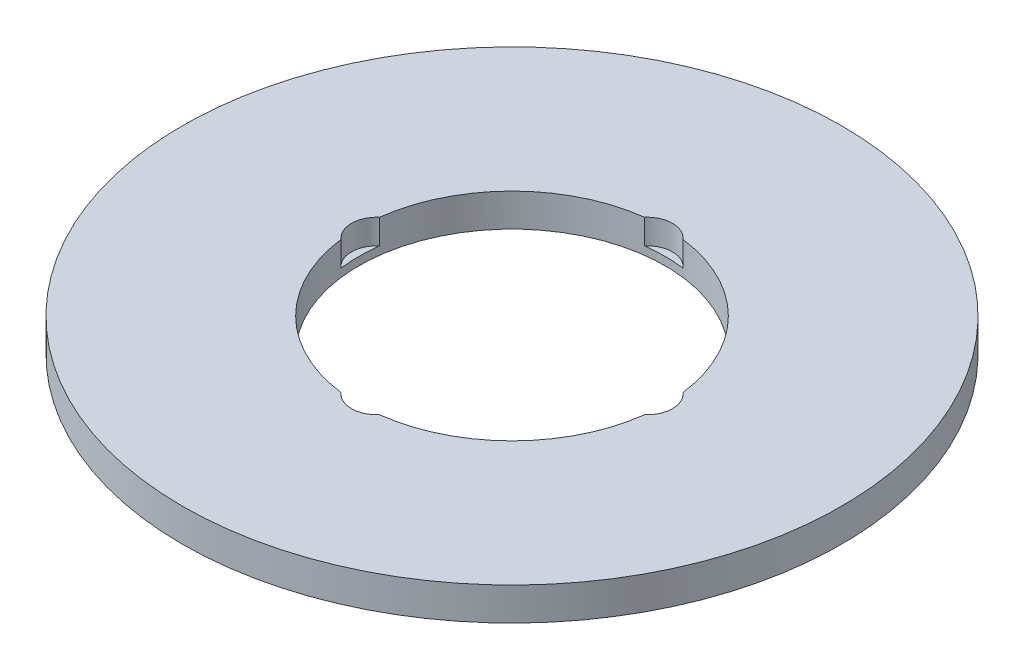
ISO-10303-21;
HEADER;
FILE_DESCRIPTION(('STEP AP214'),'2;1');
FILE_NAME('part.step','',(''),(''),'','','');
FILE_SCHEMA(('AUTOMOTIVE_DESIGN { 1 0 10303 214 1 1 1 1 }'));
ENDSEC;
DATA;
#1=APPLICATION_CONTEXT('core data for automotive mechanical design processes');
#2=APPLICATION_PROTOCOL_DEFINITION('international standard','automotive_design',2000,#1);
#3=PRODUCT_CONTEXT('',#1,'mechanical');
#4=PRODUCT('Part','Part','',(#3));
#5=PRODUCT_RELATED_PRODUCT_CATEGORY('part','',(#4));
#6=PRODUCT_DEFINITION_FORMATION('','',#4);
#7=PRODUCT_DEFINITION_CONTEXT('part definition',#1,'design');
#8=PRODUCT_DEFINITION('design','',#6,#7);
#9=PRODUCT_DEFINITION_SHAPE('','',#8);
#10=(LENGTH_UNIT() NAMED_UNIT(*) SI_UNIT(.MILLI.,.METRE.));
#11=(NAMED_UNIT(*) PLANE_ANGLE_UNIT() SI_UNIT($,.RADIAN.));
#12=(NAMED_UNIT(*) SI_UNIT($,.STERADIAN.) SOLID_ANGLE_UNIT());
#13=UNCERTAINTY_MEASURE_WITH_UNIT(LENGTH_MEASURE(1.E-05),#10,'distance_accuracy_value','');
#14=(GEOMETRIC_REPRESENTATION_CONTEXT(3) GLOBAL_UNCERTAINTY_ASSIGNED_CONTEXT((#13)) GLOBAL_UNIT_ASSIGNED_CONTEXT((#10,
#11,#12)) REPRESENTATION_CONTEXT('',''));
#15=CARTESIAN_POINT('',(0.,0.,0.));
#16=DIRECTION('',(0.,0.,1.));
#17=DIRECTION('',(1.,0.,0.));
#18=AXIS2_PLACEMENT_3D('',#15,#16,#17);
#19=CARTESIAN_POINT('',(0.,7.,0.));
#20=DIRECTION('',(0.,-1.,0.));
#21=DIRECTION('',(0.,0.,-1.));
#22=AXIS2_PLACEMENT_3D('',#19,#20,#21);
#23=CYLINDRICAL_SURFACE('',#22,70.);
#24=CARTESIAN_POINT('',(0.,7.,0.));
#25=DIRECTION('',(0.,1.,0.));
#26=DIRECTION('',(0.,0.,1.));
#27=AXIS2_PLACEMENT_3D('',#24,#25,#26);
#28=CIRCLE('',#27,70.);
#29=CARTESIAN_POINT('',(0.,7.,70.));
#30=VERTEX_POINT('',#29);
#31=EDGE_CURVE('E148',#30,#30,#28,.T.);
#32=ORIENTED_EDGE('',*,*,#31,.F.);
#33=EDGE_LOOP('',(#32));
#34=FACE_BOUND('',#33,.T.);
#35=CARTESIAN_POINT('',(0.,0.,0.));
#36=DIRECTION('',(0.,1.,0.));
#37=DIRECTION('',(0.,0.,1.));
#38=AXIS2_PLACEMENT_3D('',#35,#36,#37);
#39=CIRCLE('',#38,70.);
#40=CARTESIAN_POINT('',(0.,0.,70.));
#41=VERTEX_POINT('',#40);
#42=EDGE_CURVE('E139',#41,#41,#39,.T.);
#43=ORIENTED_EDGE('',*,*,#42,.T.);
#44=EDGE_LOOP('',(#43));
#45=FACE_BOUND('',#44,.T.);
#46=ADVANCED_FACE('F39',(#34,#45),#23,.T.);
#47=CARTESIAN_POINT('',(0.,7.,0.));
#48=DIRECTION('',(0.,1.,0.));
#49=DIRECTION('',(0.,0.,1.));
#50=AXIS2_PLACEMENT_3D('',#47,#48,#49);
#51=PLANE('',#50);
#52=CARTESIAN_POINT('',(1.00227771130218E-13,7.,28.7063745737868));
#53=DIRECTION('',(0.,1.,0.));
#54=DIRECTION('',(1.,0.,0.));
#55=AXIS2_PLACEMENT_3D('',#52,#53,#54);
#56=CIRCLE('',#55,5.39647242135596);
#57=CARTESIAN_POINT('',(-4.07567725503666,7.,32.243431190132));
#58=VERTEX_POINT('',#57);
#59=CARTESIAN_POINT('',(4.07567725503688,7.,32.243431190132));
#60=VERTEX_POINT('',#59);
#61=EDGE_CURVE('E175',#58,#60,#56,.T.);
#62=ORIENTED_EDGE('',*,*,#61,.F.);
#63=CARTESIAN_POINT('',(0.,7.,0.));
#64=DIRECTION('',(0.,1.,0.));
#65=DIRECTION('',(0.,0.,1.));
#66=AXIS2_PLACEMENT_3D('',#63,#64,#65);
#67=CIRCLE('',#66,32.5);
#68=CARTESIAN_POINT('',(-32.243431190132,7.,4.07567725503677));
#69=VERTEX_POINT('',#68);
#70=EDGE_CURVE('E134',#69,#58,#67,.T.);
#71=ORIENTED_EDGE('',*,*,#70,.F.);
#72=CARTESIAN_POINT('',(-28.7063745737868,7.,0.));
#73=DIRECTION('',(0.,1.,0.));
#74=DIRECTION('',(0.,0.,1.));
#75=AXIS2_PLACEMENT_3D('',#72,#73,#74);
#76=CIRCLE('',#75,5.39647242135596);
#77=CARTESIAN_POINT('',(-32.243431190132,7.,-4.07567725503677));
#78=VERTEX_POINT('',#77);
#79=EDGE_CURVE('E143',#78,#69,#76,.T.);
#80=ORIENTED_EDGE('',*,*,#79,.F.);
#81=CARTESIAN_POINT('',(-4.07567725503711,7.,-32.2434311901319));
#82=VERTEX_POINT('',#81);
#83=EDGE_CURVE('E123',#82,#78,#67,.T.);
#84=ORIENTED_EDGE('',*,*,#83,.F.);
#85=CARTESIAN_POINT('',(-3.00683313390653E-13,7.,-28.7063745737868));
#86=DIRECTION('',(0.,1.,0.));
#87=DIRECTION('',(-1.,0.,0.));
#88=AXIS2_PLACEMENT_3D('',#85,#86,#87);
#89=CIRCLE('',#88,5.39647242135596);
#90=CARTESIAN_POINT('',(4.07567725503643,7.,-32.243431190132));
#91=VERTEX_POINT('',#90);
#92=EDGE_CURVE('E106',#91,#82,#89,.T.);
#93=ORIENTED_EDGE('',*,*,#92,.F.);
#94=CARTESIAN_POINT('',(32.243431190132,7.,-4.07567725503677));
#95=VERTEX_POINT('',#94);
#96=EDGE_CURVE('E125',#95,#91,#67,.T.);
#97=ORIENTED_EDGE('',*,*,#96,.F.);
#98=CARTESIAN_POINT('',(28.7063745737868,7.,0.));
#99=DIRECTION('',(0.,1.,0.));
#100=DIRECTION('',(0.,0.,-1.));
#101=AXIS2_PLACEMENT_3D('',#98,#99,#100);
#102=CIRCLE('',#101,5.39647242135596);
#103=CARTESIAN_POINT('',(32.243431190132,7.,4.07567725503677));
#104=VERTEX_POINT('',#103);
#105=EDGE_CURVE('E286',#104,#95,#102,.T.);
#106=ORIENTED_EDGE('',*,*,#105,.F.);
#107=EDGE_CURVE('E135',#60,#104,#67,.T.);
#108=ORIENTED_EDGE('',*,*,#107,.F.);
#109=EDGE_LOOP('',(#62,#71,#80,#84,#93,#97,#106,#108));
#110=FACE_BOUND('',#109,.T.);
#111=ORIENTED_EDGE('',*,*,#31,.T.);
#112=EDGE_LOOP('',(#111));
#113=FACE_BOUND('',#112,.T.);
#114=ADVANCED_FACE('F118',(#110,#113),#51,.T.);
#115=CARTESIAN_POINT('',(0.,0.,0.));
#116=DIRECTION('',(0.,1.,0.));
#117=DIRECTION('',(0.,0.,1.));
#118=AXIS2_PLACEMENT_3D('',#115,#116,#117);
#119=PLANE('',#118);
#120=CARTESIAN_POINT('',(0.,0.,0.));
#121=DIRECTION('',(0.,1.,0.));
#122=DIRECTION('',(0.,0.,1.));
#123=AXIS2_PLACEMENT_3D('',#120,#121,#122);
#124=CIRCLE('',#123,32.5);
#125=CARTESIAN_POINT('',(0.,0.,32.5));
#126=VERTEX_POINT('',#125);
#127=EDGE_CURVE('E136',#126,#126,#124,.T.);
#128=ORIENTED_EDGE('',*,*,#127,.T.);
#129=EDGE_LOOP('',(#128));
#130=FACE_BOUND('',#129,.T.);
#131=ORIENTED_EDGE('',*,*,#42,.F.);
#132=EDGE_LOOP('',(#131));
#133=FACE_BOUND('',#132,.T.);
#134=ADVANCED_FACE('F187',(#130,#133),#119,.F.);
#135=CARTESIAN_POINT('',(0.,7.,0.));
#136=DIRECTION('',(0.,-1.,0.));
#137=DIRECTION('',(0.,0.,-1.));
#138=AXIS2_PLACEMENT_3D('',#135,#136,#137);
#139=CYLINDRICAL_SURFACE('',#138,32.5);
#140=DIRECTION('',(0.,1.,0.));
#141=VECTOR('',#140,1.);
#142=CARTESIAN_POINT('',(-4.07567725503666,4.36564411451568,32.243431190132));
#143=LINE('',#142,#141);
#144=CARTESIAN_POINT('',(-4.07567725503666,1.73128822903137,32.243431190132));
#145=VERTEX_POINT('',#144);
#146=EDGE_CURVE('E11',#145,#58,#143,.T.);
#147=ORIENTED_EDGE('',*,*,#146,.F.);
#148=CARTESIAN_POINT('',(0.,1.73128822903137,0.));
#149=DIRECTION('',(0.,1.,0.));
#150=DIRECTION('',(0.,0.,1.));
#151=AXIS2_PLACEMENT_3D('',#148,#149,#150);
#152=CIRCLE('',#151,32.5);
#153=CARTESIAN_POINT('',(4.07567725503688,1.73128822903137,32.243431190132));
#154=VERTEX_POINT('',#153);
#155=EDGE_CURVE('E170',#145,#154,#152,.T.);
#156=ORIENTED_EDGE('',*,*,#155,.T.);
#157=DIRECTION('',(0.,1.,0.));
#158=VECTOR('',#157,1.);
#159=CARTESIAN_POINT('',(4.07567725503688,4.36564411451568,32.243431190132));
#160=LINE('',#159,#158);
#161=EDGE_CURVE('E46',#60,#154,#160,.F.);
#162=ORIENTED_EDGE('',*,*,#161,.F.);
#163=ORIENTED_EDGE('',*,*,#107,.T.);
#164=DIRECTION('',(0.,1.,0.));
#165=VECTOR('',#164,1.);
#166=CARTESIAN_POINT('',(32.243431190132,4.36564411451568,4.07567725503677));
#167=LINE('',#166,#165);
#168=CARTESIAN_POINT('',(32.243431190132,1.73128822903137,4.07567725503677));
#169=VERTEX_POINT('',#168);
#170=EDGE_CURVE('E164',#169,#104,#167,.T.);
#171=ORIENTED_EDGE('',*,*,#170,.F.);
#172=CARTESIAN_POINT('',(0.,1.73128822903137,0.));
#173=DIRECTION('',(0.,1.,0.));
#174=DIRECTION('',(0.,0.,1.));
#175=AXIS2_PLACEMENT_3D('',#172,#173,#174);
#176=CIRCLE('',#175,32.5);
#177=CARTESIAN_POINT('',(32.243431190132,1.73128822903137,-4.07567725503677));
#178=VERTEX_POINT('',#177);
#179=EDGE_CURVE('E115',#169,#178,#176,.T.);
#180=ORIENTED_EDGE('',*,*,#179,.T.);
#181=DIRECTION('',(0.,1.,0.));
#182=VECTOR('',#181,1.);
#183=CARTESIAN_POINT('',(32.243431190132,4.36564411451568,-4.07567725503677));
#184=LINE('',#183,#182);
#185=EDGE_CURVE('E131',#95,#178,#184,.F.);
#186=ORIENTED_EDGE('',*,*,#185,.F.);
#187=ORIENTED_EDGE('',*,*,#96,.T.);
#188=DIRECTION('',(0.,1.,0.));
#189=VECTOR('',#188,1.);
#190=CARTESIAN_POINT('',(4.07567725503643,4.36564411451568,-32.243431190132));
#191=LINE('',#190,#189);
#192=CARTESIAN_POINT('',(4.07567725503643,1.73128822903137,-32.243431190132));
#193=VERTEX_POINT('',#192);
#194=EDGE_CURVE('E105',#193,#91,#191,.T.);
#195=ORIENTED_EDGE('',*,*,#194,.F.);
#196=CARTESIAN_POINT('',(0.,1.73128822903137,0.));
#197=DIRECTION('',(0.,1.,0.));
#198=DIRECTION('',(0.,0.,1.));
#199=AXIS2_PLACEMENT_3D('',#196,#197,#198);
#200=CIRCLE('',#199,32.5);
#201=CARTESIAN_POINT('',(-4.07567725503711,1.73128822903137,-32.2434311901319));
#202=VERTEX_POINT('',#201);
#203=EDGE_CURVE('E159',#193,#202,#200,.T.);
#204=ORIENTED_EDGE('',*,*,#203,.T.);
#205=DIRECTION('',(0.,1.,0.));
#206=VECTOR('',#205,1.);
#207=CARTESIAN_POINT('',(-4.07567725503711,4.36564411451568,-32.2434311901319));
#208=LINE('',#207,#206);
#209=EDGE_CURVE('E114',#82,#202,#208,.F.);
#210=ORIENTED_EDGE('',*,*,#209,.F.);
#211=ORIENTED_EDGE('',*,*,#83,.T.);
#212=DIRECTION('',(0.,1.,0.));
#213=VECTOR('',#212,1.);
#214=CARTESIAN_POINT('',(-32.243431190132,4.36564411451568,-4.07567725503677));
#215=LINE('',#214,#213);
#216=CARTESIAN_POINT('',(-32.243431190132,1.73128822903137,-4.07567725503677));
#217=VERTEX_POINT('',#216);
#218=EDGE_CURVE('E160',#217,#78,#215,.T.);
#219=ORIENTED_EDGE('',*,*,#218,.F.);
#220=CARTESIAN_POINT('',(0.,1.73128822903137,0.));
#221=DIRECTION('',(0.,1.,0.));
#222=DIRECTION('',(0.,0.,1.));
#223=AXIS2_PLACEMENT_3D('',#220,#221,#222);
#224=CIRCLE('',#223,32.5);
#225=CARTESIAN_POINT('',(-32.243431190132,1.73128822903137,4.07567725503677));
#226=VERTEX_POINT('',#225);
#227=EDGE_CURVE('E149',#217,#226,#224,.T.);
#228=ORIENTED_EDGE('',*,*,#227,.T.);
#229=DIRECTION('',(0.,1.,0.));
#230=VECTOR('',#229,1.);
#231=CARTESIAN_POINT('',(-32.243431190132,4.36564411451568,4.07567725503677));
#232=LINE('',#231,#230);
#233=EDGE_CURVE('E152',#69,#226,#232,.F.);
#234=ORIENTED_EDGE('',*,*,#233,.F.);
#235=ORIENTED_EDGE('',*,*,#70,.T.);
#236=EDGE_LOOP('',(#147,#156,#162,#163,#171,#180,#186,#187,#195,#204,#210,#211,#219,#228,#234,#235));
#237=FACE_BOUND('',#236,.T.);
#238=ORIENTED_EDGE('',*,*,#127,.F.);
#239=EDGE_LOOP('',(#238));
#240=FACE_BOUND('',#239,.T.);
#241=ADVANCED_FACE('F126',(#237,#240),#139,.F.);
#242=CARTESIAN_POINT('',(-28.7063745737868,1.73128822903137,0.));
#243=DIRECTION('',(0.,1.,0.));
#244=DIRECTION('',(0.,0.,1.));
#245=AXIS2_PLACEMENT_3D('',#242,#243,#244);
#246=CYLINDRICAL_SURFACE('',#245,5.39647242135596);
#247=ORIENTED_EDGE('',*,*,#218,.T.);
#248=ORIENTED_EDGE('',*,*,#79,.T.);
#249=ORIENTED_EDGE('',*,*,#233,.T.);
#250=CARTESIAN_POINT('',(-28.7063745737868,1.73128822903137,0.));
#251=DIRECTION('',(0.,1.,0.));
#252=DIRECTION('',(0.,0.,1.));
#253=AXIS2_PLACEMENT_3D('',#250,#251,#252);
#254=CIRCLE('',#253,5.39647242135596);
#255=EDGE_CURVE('E144',#217,#226,#254,.T.);
#256=ORIENTED_EDGE('',*,*,#255,.F.);
#257=EDGE_LOOP('',(#247,#248,#249,#256));
#258=FACE_BOUND('',#257,.T.);
#259=ADVANCED_FACE('F200',(#258),#246,.F.);
#260=CARTESIAN_POINT('',(-28.7063745737868,1.73128822903137,0.));
#261=DIRECTION('',(0.,1.,0.));
#262=DIRECTION('',(0.,0.,1.));
#263=AXIS2_PLACEMENT_3D('',#260,#261,#262);
#264=PLANE('',#263);
#265=ORIENTED_EDGE('',*,*,#255,.T.);
#266=ORIENTED_EDGE('',*,*,#227,.F.);
#267=EDGE_LOOP('',(#265,#266));
#268=FACE_BOUND('',#267,.T.);
#269=ADVANCED_FACE('F201',(#268),#264,.T.);
#270=CARTESIAN_POINT('',(-3.00683313390653E-13,1.73128822903137,-28.7063745737868));
#271=DIRECTION('',(0.,1.,0.));
#272=DIRECTION('',(0.,0.,1.));
#273=AXIS2_PLACEMENT_3D('',#270,#271,#272);
#274=CYLINDRICAL_SURFACE('',#273,5.39647242135596);
#275=ORIENTED_EDGE('',*,*,#194,.T.);
#276=ORIENTED_EDGE('',*,*,#92,.T.);
#277=ORIENTED_EDGE('',*,*,#209,.T.);
#278=CARTESIAN_POINT('',(-3.00683313390653E-13,1.73128822903137,-28.7063745737868));
#279=DIRECTION('',(0.,1.,0.));
#280=DIRECTION('',(-1.,0.,0.));
#281=AXIS2_PLACEMENT_3D('',#278,#279,#280);
#282=CIRCLE('',#281,5.39647242135596);
#283=EDGE_CURVE('E107',#193,#202,#282,.T.);
#284=ORIENTED_EDGE('',*,*,#283,.F.);
#285=EDGE_LOOP('',(#275,#276,#277,#284));
#286=FACE_BOUND('',#285,.T.);
#287=ADVANCED_FACE('F102',(#286),#274,.F.);
#288=CARTESIAN_POINT('',(-3.00683313390653E-13,1.73128822903137,-28.7063745737868));
#289=DIRECTION('',(0.,1.,0.));
#290=DIRECTION('',(-1.,0.,0.));
#291=AXIS2_PLACEMENT_3D('',#288,#289,#290);
#292=PLANE('',#291);
#293=ORIENTED_EDGE('',*,*,#283,.T.);
#294=ORIENTED_EDGE('',*,*,#203,.F.);
#295=EDGE_LOOP('',(#293,#294));
#296=FACE_BOUND('',#295,.T.);
#297=ADVANCED_FACE('F209',(#296),#292,.T.);
#298=CARTESIAN_POINT('',(28.7063745737868,1.73128822903137,0.));
#299=DIRECTION('',(0.,1.,0.));
#300=DIRECTION('',(0.,0.,1.));
#301=AXIS2_PLACEMENT_3D('',#298,#299,#300);
#302=CYLINDRICAL_SURFACE('',#301,5.39647242135596);
#303=ORIENTED_EDGE('',*,*,#170,.T.);
#304=ORIENTED_EDGE('',*,*,#105,.T.);
#305=ORIENTED_EDGE('',*,*,#185,.T.);
#306=CARTESIAN_POINT('',(28.7063745737868,1.73128822903137,0.));
#307=DIRECTION('',(0.,1.,0.));
#308=DIRECTION('',(0.,0.,-1.));
#309=AXIS2_PLACEMENT_3D('',#306,#307,#308);
#310=CIRCLE('',#309,5.39647242135596);
#311=EDGE_CURVE('E56',#169,#178,#310,.T.);
#312=ORIENTED_EDGE('',*,*,#311,.F.);
#313=EDGE_LOOP('',(#303,#304,#305,#312));
#314=FACE_BOUND('',#313,.T.);
#315=ADVANCED_FACE('F213',(#314),#302,.F.);
#316=CARTESIAN_POINT('',(28.7063745737868,1.73128822903137,0.));
#317=DIRECTION('',(0.,1.,0.));
#318=DIRECTION('',(0.,0.,-1.));
#319=AXIS2_PLACEMENT_3D('',#316,#317,#318);
#320=PLANE('',#319);
#321=ORIENTED_EDGE('',*,*,#311,.T.);
#322=ORIENTED_EDGE('',*,*,#179,.F.);
#323=EDGE_LOOP('',(#321,#322));
#324=FACE_BOUND('',#323,.T.);
#325=ADVANCED_FACE('F179',(#324),#320,.T.);
#326=CARTESIAN_POINT('',(1.00227771130218E-13,1.73128822903137,28.7063745737868));
#327=DIRECTION('',(0.,1.,0.));
#328=DIRECTION('',(0.,0.,1.));
#329=AXIS2_PLACEMENT_3D('',#326,#327,#328);
#330=CYLINDRICAL_SURFACE('',#329,5.39647242135596);
#331=ORIENTED_EDGE('',*,*,#146,.T.);
#332=ORIENTED_EDGE('',*,*,#61,.T.);
#333=ORIENTED_EDGE('',*,*,#161,.T.);
#334=CARTESIAN_POINT('',(1.00227771130218E-13,1.73128822903137,28.7063745737868));
#335=DIRECTION('',(0.,1.,0.));
#336=DIRECTION('',(1.,0.,0.));
#337=AXIS2_PLACEMENT_3D('',#334,#335,#336);
#338=CIRCLE('',#337,5.39647242135596);
#339=EDGE_CURVE('E55',#145,#154,#338,.T.);
#340=ORIENTED_EDGE('',*,*,#339,.F.);
#341=EDGE_LOOP('',(#331,#332,#333,#340));
#342=FACE_BOUND('',#341,.T.);
#343=ADVANCED_FACE('F171',(#342),#330,.F.);
#344=CARTESIAN_POINT('',(1.00227771130218E-13,1.73128822903137,28.7063745737868));
#345=DIRECTION('',(0.,1.,0.));
#346=DIRECTION('',(1.,0.,0.));
#347=AXIS2_PLACEMENT_3D('',#344,#345,#346);
#348=PLANE('',#347);
#349=ORIENTED_EDGE('',*,*,#339,.T.);
#350=ORIENTED_EDGE('',*,*,#155,.F.);
#351=EDGE_LOOP('',(#349,#350));
#352=FACE_BOUND('',#351,.T.);
#353=ADVANCED_FACE('F173',(#352),#348,.T.);
#354=CLOSED_SHELL('',(#46,#114,#134,#241,#259,#269,#287,#297,#315,#325,#343,#353));
#355=MANIFOLD_SOLID_BREP('B2',#354);
#356=ADVANCED_BREP_SHAPE_REPRESENTATION('',(#18,#355),#14);
#357=SHAPE_DEFINITION_REPRESENTATION(#9,#356);
ENDSEC;
END-ISO-10303-21;
